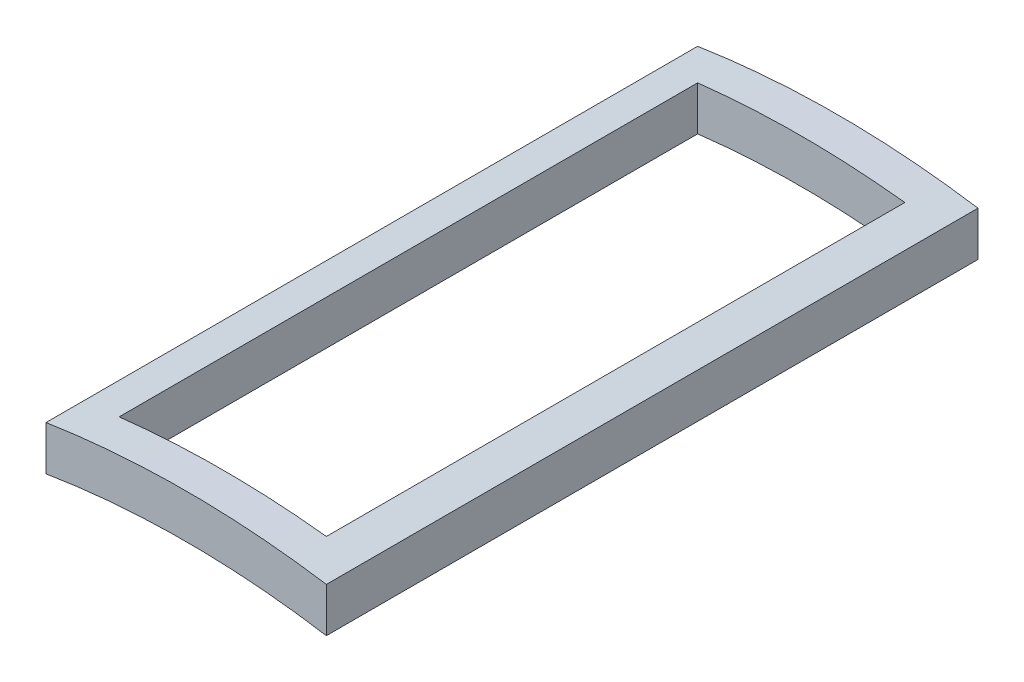
ISO-10303-21;
HEADER;
FILE_DESCRIPTION(('STEP AP214'),'2;1');
FILE_NAME('part.step','',(''),(''),'','','');
FILE_SCHEMA(('AUTOMOTIVE_DESIGN { 1 0 10303 214 1 1 1 1 }'));
ENDSEC;
DATA;
#1=APPLICATION_CONTEXT('core data for automotive mechanical design processes');
#2=APPLICATION_PROTOCOL_DEFINITION('international standard','automotive_design',2000,#1);
#3=PRODUCT_CONTEXT('',#1,'mechanical');
#4=PRODUCT('Part','Part','',(#3));
#5=PRODUCT_RELATED_PRODUCT_CATEGORY('part','',(#4));
#6=PRODUCT_DEFINITION_FORMATION('','',#4);
#7=PRODUCT_DEFINITION_CONTEXT('part definition',#1,'design');
#8=PRODUCT_DEFINITION('design','',#6,#7);
#9=PRODUCT_DEFINITION_SHAPE('','',#8);
#10=(LENGTH_UNIT() NAMED_UNIT(*) SI_UNIT(.MILLI.,.METRE.));
#11=(NAMED_UNIT(*) PLANE_ANGLE_UNIT() SI_UNIT($,.RADIAN.));
#12=(NAMED_UNIT(*) SI_UNIT($,.STERADIAN.) SOLID_ANGLE_UNIT());
#13=UNCERTAINTY_MEASURE_WITH_UNIT(LENGTH_MEASURE(1.E-05),#10,'distance_accuracy_value','');
#14=(GEOMETRIC_REPRESENTATION_CONTEXT(3) GLOBAL_UNCERTAINTY_ASSIGNED_CONTEXT((#13)) GLOBAL_UNIT_ASSIGNED_CONTEXT((#10,
#11,#12)) REPRESENTATION_CONTEXT('',''));
#15=CARTESIAN_POINT('',(0.,0.,0.));
#16=DIRECTION('',(0.,0.,1.));
#17=DIRECTION('',(1.,0.,0.));
#18=AXIS2_PLACEMENT_3D('',#15,#16,#17);
#19=CARTESIAN_POINT('',(-110.435261655171,-75.8999546142995,6.56206354763538));
#20=DIRECTION('',(0.,0.,1.));
#21=DIRECTION('',(0.,-1.,0.));
#22=AXIS2_PLACEMENT_3D('',#19,#20,#21);
#23=CYLINDRICAL_SURFACE('',#22,2.50000000000002);
#24=DIRECTION('',(0.,0.,1.));
#25=VECTOR('',#24,1.);
#26=CARTESIAN_POINT('',(-110.152003047214,-73.4160535371593,5.48543056897769));
#27=LINE('',#26,#25);
#28=CARTESIAN_POINT('',(-110.152003047214,-73.4160535371593,5.48543056897769));
#29=VERTEX_POINT('',#28);
#30=CARTESIAN_POINT('',(-110.152003047214,-73.4160535371593,3.90390334121821));
#31=VERTEX_POINT('',#30);
#32=EDGE_CURVE('E83',#29,#31,#27,.F.);
#33=ORIENTED_EDGE('',*,*,#32,.F.);
#34=CARTESIAN_POINT('',(-110.435261655171,-75.8999546142995,5.48543056897769));
#35=DIRECTION('',(0.,0.,1.));
#36=DIRECTION('',(0.,-1.,0.));
#37=AXIS2_PLACEMENT_3D('',#34,#35,#36);
#38=CIRCLE('',#37,2.50000000000002);
#39=CARTESIAN_POINT('',(-110.718520263128,-73.4160535371593,5.48543056897769));
#40=VERTEX_POINT('',#39);
#41=EDGE_CURVE('E93',#40,#29,#38,.F.);
#42=ORIENTED_EDGE('',*,*,#41,.F.);
#43=DIRECTION('',(0.,0.,-1.));
#44=VECTOR('',#43,1.);
#45=CARTESIAN_POINT('',(-110.718520263128,-73.4160535371594,3.90390334121821));
#46=LINE('',#45,#44);
#47=CARTESIAN_POINT('',(-110.718520263128,-73.4160535371593,3.90390334121821));
#48=VERTEX_POINT('',#47);
#49=EDGE_CURVE('E85',#48,#40,#46,.F.);
#50=ORIENTED_EDGE('',*,*,#49,.F.);
#51=CARTESIAN_POINT('',(-110.435261655171,-75.8999546142995,3.90390334121821));
#52=DIRECTION('',(0.,0.,1.));
#53=DIRECTION('',(0.,-1.,0.));
#54=AXIS2_PLACEMENT_3D('',#51,#52,#53);
#55=CIRCLE('',#54,2.50000000000002);
#56=EDGE_CURVE('E20',#48,#31,#55,.F.);
#57=ORIENTED_EDGE('',*,*,#56,.T.);
#58=EDGE_LOOP('',(#33,#42,#50,#57));
#59=FACE_BOUND('',#58,.T.);
#60=CARTESIAN_POINT('',(-110.435261655171,-75.8999546142995,5.58543056897769));
#61=DIRECTION('',(0.,0.,1.));
#62=DIRECTION('',(0.,-1.,0.));
#63=AXIS2_PLACEMENT_3D('',#60,#61,#62);
#64=CIRCLE('',#63,2.50000000000002);
#65=CARTESIAN_POINT('',(-110.052003047214,-73.4295067117063,5.58543056897769));
#66=VERTEX_POINT('',#65);
#67=CARTESIAN_POINT('',(-110.818520263128,-73.4295067117064,5.58543056897769));
#68=VERTEX_POINT('',#67);
#69=EDGE_CURVE('E86',#66,#68,#64,.T.);
#70=ORIENTED_EDGE('',*,*,#69,.F.);
#71=DIRECTION('',(0.,0.,-1.));
#72=VECTOR('',#71,1.);
#73=CARTESIAN_POINT('',(-110.052003047214,-73.4295067117063,3.80390334121821));
#74=LINE('',#73,#72);
#75=CARTESIAN_POINT('',(-110.052003047214,-73.4295067117063,3.80390334121821));
#76=VERTEX_POINT('',#75);
#77=EDGE_CURVE('E124',#76,#66,#74,.F.);
#78=ORIENTED_EDGE('',*,*,#77,.F.);
#79=CARTESIAN_POINT('',(-110.435261655171,-75.8999546142995,3.80390334121821));
#80=DIRECTION('',(0.,0.,1.));
#81=DIRECTION('',(0.,-1.,0.));
#82=AXIS2_PLACEMENT_3D('',#79,#80,#81);
#83=CIRCLE('',#82,2.50000000000002);
#84=CARTESIAN_POINT('',(-110.818520263128,-73.4295067117064,3.80390334121821));
#85=VERTEX_POINT('',#84);
#86=EDGE_CURVE('E113',#85,#76,#83,.F.);
#87=ORIENTED_EDGE('',*,*,#86,.F.);
#88=DIRECTION('',(0.,0.,1.));
#89=VECTOR('',#88,1.);
#90=CARTESIAN_POINT('',(-110.818520263128,-73.4295067117064,5.58543056897769));
#91=LINE('',#90,#89);
#92=EDGE_CURVE('E121',#68,#85,#91,.F.);
#93=ORIENTED_EDGE('',*,*,#92,.F.);
#94=EDGE_LOOP('',(#70,#78,#87,#93));
#95=FACE_BOUND('',#94,.T.);
#96=ADVANCED_FACE('F17',(#59,#95),#23,.T.);
#97=CARTESIAN_POINT('',(-110.052003047214,-76.3010935552146,5.58543056897769));
#98=DIRECTION('',(0.,0.,1.));
#99=DIRECTION('',(0.,-1.,0.));
#100=AXIS2_PLACEMENT_3D('',#97,#98,#99);
#101=PLANE('',#100);
#102=ORIENTED_EDGE('',*,*,#69,.T.);
#103=DIRECTION('',(0.,1.,0.));
#104=VECTOR('',#103,1.);
#105=CARTESIAN_POINT('',(-110.818520263128,-76.3010935552146,5.58543056897769));
#106=LINE('',#105,#104);
#107=CARTESIAN_POINT('',(-110.818520263128,-73.5510159519614,5.58543056897769));
#108=VERTEX_POINT('',#107);
#109=EDGE_CURVE('E112',#108,#68,#106,.T.);
#110=ORIENTED_EDGE('',*,*,#109,.F.);
#111=CARTESIAN_POINT('',(-110.435261655171,-75.8999546142995,5.58543056897769));
#112=DIRECTION('',(0.,0.,1.));
#113=DIRECTION('',(0.,-1.,0.));
#114=AXIS2_PLACEMENT_3D('',#111,#112,#113);
#115=CIRCLE('',#114,2.38000000000001);
#116=CARTESIAN_POINT('',(-110.052003047214,-73.5510159519614,5.58543056897769));
#117=VERTEX_POINT('',#116);
#118=EDGE_CURVE('E99',#108,#117,#115,.F.);
#119=ORIENTED_EDGE('',*,*,#118,.T.);
#120=DIRECTION('',(0.,1.,0.));
#121=VECTOR('',#120,1.);
#122=CARTESIAN_POINT('',(-110.052003047214,-76.3010935552146,5.58543056897769));
#123=LINE('',#122,#121);
#124=EDGE_CURVE('E122',#66,#117,#123,.F.);
#125=ORIENTED_EDGE('',*,*,#124,.F.);
#126=EDGE_LOOP('',(#102,#110,#119,#125));
#127=FACE_BOUND('',#126,.T.);
#128=ADVANCED_FACE('F141',(#127),#101,.T.);
#129=CARTESIAN_POINT('',(-110.052003047214,-76.3010935552146,3.80390334121821));
#130=DIRECTION('',(1.,0.,0.));
#131=DIRECTION('',(0.,0.,-1.));
#132=AXIS2_PLACEMENT_3D('',#129,#130,#131);
#133=PLANE('',#132);
#134=ORIENTED_EDGE('',*,*,#77,.T.);
#135=ORIENTED_EDGE('',*,*,#124,.T.);
#136=DIRECTION('',(0.,0.,1.));
#137=VECTOR('',#136,1.);
#138=CARTESIAN_POINT('',(-110.052003047214,-73.5510159519614,6.56206354763538));
#139=LINE('',#138,#137);
#140=CARTESIAN_POINT('',(-110.052003047214,-73.5510159519614,3.80390334121821));
#141=VERTEX_POINT('',#140);
#142=EDGE_CURVE('E114',#117,#141,#139,.F.);
#143=ORIENTED_EDGE('',*,*,#142,.T.);
#144=DIRECTION('',(0.,1.,0.));
#145=VECTOR('',#144,1.);
#146=CARTESIAN_POINT('',(-110.052003047214,-76.3010935552146,3.80390334121821));
#147=LINE('',#146,#145);
#148=EDGE_CURVE('E110',#76,#141,#147,.F.);
#149=ORIENTED_EDGE('',*,*,#148,.F.);
#150=EDGE_LOOP('',(#134,#135,#143,#149));
#151=FACE_BOUND('',#150,.T.);
#152=ADVANCED_FACE('F157',(#151),#133,.T.);
#153=CARTESIAN_POINT('',(-110.818520263128,-76.3010935552146,3.80390334121821));
#154=DIRECTION('',(0.,0.,-1.));
#155=DIRECTION('',(0.,1.,0.));
#156=AXIS2_PLACEMENT_3D('',#153,#154,#155);
#157=PLANE('',#156);
#158=ORIENTED_EDGE('',*,*,#86,.T.);
#159=ORIENTED_EDGE('',*,*,#148,.T.);
#160=CARTESIAN_POINT('',(-110.435261655171,-75.8999546142995,3.80390334121821));
#161=DIRECTION('',(0.,0.,1.));
#162=DIRECTION('',(0.,-1.,0.));
#163=AXIS2_PLACEMENT_3D('',#160,#161,#162);
#164=CIRCLE('',#163,2.38000000000001);
#165=CARTESIAN_POINT('',(-110.818520263128,-73.5510159519614,3.80390334121821));
#166=VERTEX_POINT('',#165);
#167=EDGE_CURVE('E117',#141,#166,#164,.T.);
#168=ORIENTED_EDGE('',*,*,#167,.T.);
#169=DIRECTION('',(0.,1.,0.));
#170=VECTOR('',#169,1.);
#171=CARTESIAN_POINT('',(-110.818520263128,-76.3010935552146,3.80390334121821));
#172=LINE('',#171,#170);
#173=EDGE_CURVE('E94',#85,#166,#172,.F.);
#174=ORIENTED_EDGE('',*,*,#173,.F.);
#175=EDGE_LOOP('',(#158,#159,#168,#174));
#176=FACE_BOUND('',#175,.T.);
#177=ADVANCED_FACE('F151',(#176),#157,.T.);
#178=CARTESIAN_POINT('',(-110.818520263128,-76.3010935552146,5.58543056897769));
#179=DIRECTION('',(-1.,0.,0.));
#180=DIRECTION('',(0.,0.,1.));
#181=AXIS2_PLACEMENT_3D('',#178,#179,#180);
#182=PLANE('',#181);
#183=ORIENTED_EDGE('',*,*,#92,.T.);
#184=ORIENTED_EDGE('',*,*,#173,.T.);
#185=DIRECTION('',(0.,0.,1.));
#186=VECTOR('',#185,1.);
#187=CARTESIAN_POINT('',(-110.818520263128,-73.5510159519614,6.56206354763538));
#188=LINE('',#187,#186);
#189=EDGE_CURVE('E107',#166,#108,#188,.T.);
#190=ORIENTED_EDGE('',*,*,#189,.T.);
#191=ORIENTED_EDGE('',*,*,#109,.T.);
#192=EDGE_LOOP('',(#183,#184,#190,#191));
#193=FACE_BOUND('',#192,.T.);
#194=ADVANCED_FACE('F145',(#193),#182,.T.);
#195=CARTESIAN_POINT('',(-110.152003047214,-76.3010935552146,5.48543056897769));
#196=DIRECTION('',(-1.,0.,0.));
#197=DIRECTION('',(0.,0.,1.));
#198=AXIS2_PLACEMENT_3D('',#195,#196,#197);
#199=PLANE('',#198);
#200=ORIENTED_EDGE('',*,*,#32,.T.);
#201=DIRECTION('',(0.,-1.,0.));
#202=VECTOR('',#201,1.);
#203=CARTESIAN_POINT('',(-110.152003047214,-76.3010935552146,3.90390334121821));
#204=LINE('',#203,#202);
#205=CARTESIAN_POINT('',(-110.152003047214,-73.5368709168782,3.90390334121821));
#206=VERTEX_POINT('',#205);
#207=EDGE_CURVE('E91',#206,#31,#204,.F.);
#208=ORIENTED_EDGE('',*,*,#207,.F.);
#209=DIRECTION('',(0.,0.,1.));
#210=VECTOR('',#209,1.);
#211=CARTESIAN_POINT('',(-110.152003047214,-73.5368709168782,6.56206354763538));
#212=LINE('',#211,#210);
#213=CARTESIAN_POINT('',(-110.152003047214,-73.5368709168782,5.48543056897769));
#214=VERTEX_POINT('',#213);
#215=EDGE_CURVE('E106',#206,#214,#212,.T.);
#216=ORIENTED_EDGE('',*,*,#215,.T.);
#217=DIRECTION('',(0.,1.,0.));
#218=VECTOR('',#217,1.);
#219=CARTESIAN_POINT('',(-110.152003047214,-76.3010935552146,5.48543056897769));
#220=LINE('',#219,#218);
#221=EDGE_CURVE('E92',#29,#214,#220,.F.);
#222=ORIENTED_EDGE('',*,*,#221,.F.);
#223=EDGE_LOOP('',(#200,#208,#216,#222));
#224=FACE_BOUND('',#223,.T.);
#225=ADVANCED_FACE('F89',(#224),#199,.T.);
#226=CARTESIAN_POINT('',(-110.718520263128,-76.3010935552146,5.48543056897769));
#227=DIRECTION('',(0.,0.,-1.));
#228=DIRECTION('',(0.,1.,0.));
#229=AXIS2_PLACEMENT_3D('',#226,#227,#228);
#230=PLANE('',#229);
#231=ORIENTED_EDGE('',*,*,#41,.T.);
#232=ORIENTED_EDGE('',*,*,#221,.T.);
#233=CARTESIAN_POINT('',(-110.435261655171,-75.8999546142995,5.48543056897769));
#234=DIRECTION('',(0.,0.,1.));
#235=DIRECTION('',(0.,-1.,0.));
#236=AXIS2_PLACEMENT_3D('',#233,#234,#235);
#237=CIRCLE('',#236,2.38000000000001);
#238=CARTESIAN_POINT('',(-110.718520263128,-73.5368709168782,5.48543056897769));
#239=VERTEX_POINT('',#238);
#240=EDGE_CURVE('E105',#214,#239,#237,.T.);
#241=ORIENTED_EDGE('',*,*,#240,.T.);
#242=DIRECTION('',(0.,1.,0.));
#243=VECTOR('',#242,1.);
#244=CARTESIAN_POINT('',(-110.718520263128,-76.3010935552146,5.48543056897769));
#245=LINE('',#244,#243);
#246=EDGE_CURVE('E97',#40,#239,#245,.F.);
#247=ORIENTED_EDGE('',*,*,#246,.F.);
#248=EDGE_LOOP('',(#231,#232,#241,#247));
#249=FACE_BOUND('',#248,.T.);
#250=ADVANCED_FACE('F178',(#249),#230,.T.);
#251=CARTESIAN_POINT('',(-110.718520263128,-76.3010935552146,3.90390334121821));
#252=DIRECTION('',(1.,0.,0.));
#253=DIRECTION('',(0.,0.,-1.));
#254=AXIS2_PLACEMENT_3D('',#251,#252,#253);
#255=PLANE('',#254);
#256=ORIENTED_EDGE('',*,*,#49,.T.);
#257=ORIENTED_EDGE('',*,*,#246,.T.);
#258=DIRECTION('',(0.,0.,1.));
#259=VECTOR('',#258,1.);
#260=CARTESIAN_POINT('',(-110.718520263128,-73.5368709168782,6.56206354763538));
#261=LINE('',#260,#259);
#262=CARTESIAN_POINT('',(-110.718520263128,-73.5368709168782,3.90390334121821));
#263=VERTEX_POINT('',#262);
#264=EDGE_CURVE('E26',#239,#263,#261,.F.);
#265=ORIENTED_EDGE('',*,*,#264,.T.);
#266=DIRECTION('',(0.,-1.,0.));
#267=VECTOR('',#266,1.);
#268=CARTESIAN_POINT('',(-110.718520263128,-76.3010935552146,3.90390334121821));
#269=LINE('',#268,#267);
#270=EDGE_CURVE('E34',#48,#263,#269,.T.);
#271=ORIENTED_EDGE('',*,*,#270,.F.);
#272=EDGE_LOOP('',(#256,#257,#265,#271));
#273=FACE_BOUND('',#272,.T.);
#274=ADVANCED_FACE('F172',(#273),#255,.T.);
#275=CARTESIAN_POINT('',(-110.152003047214,-76.3010935552146,3.90390334121821));
#276=DIRECTION('',(0.,0.,1.));
#277=DIRECTION('',(0.,-1.,0.));
#278=AXIS2_PLACEMENT_3D('',#275,#276,#277);
#279=PLANE('',#278);
#280=ORIENTED_EDGE('',*,*,#56,.F.);
#281=ORIENTED_EDGE('',*,*,#270,.T.);
#282=CARTESIAN_POINT('',(-110.435261655171,-75.8999546142995,3.90390334121821));
#283=DIRECTION('',(0.,0.,1.));
#284=DIRECTION('',(0.,-1.,0.));
#285=AXIS2_PLACEMENT_3D('',#282,#283,#284);
#286=CIRCLE('',#285,2.38000000000001);
#287=EDGE_CURVE('E11',#263,#206,#286,.F.);
#288=ORIENTED_EDGE('',*,*,#287,.T.);
#289=ORIENTED_EDGE('',*,*,#207,.T.);
#290=EDGE_LOOP('',(#280,#281,#288,#289));
#291=FACE_BOUND('',#290,.T.);
#292=ADVANCED_FACE('F96',(#291),#279,.T.);
#293=CARTESIAN_POINT('',(-110.435261655171,-75.8999546142995,6.56206354763538));
#294=DIRECTION('',(0.,0.,1.));
#295=DIRECTION('',(0.,-1.,0.));
#296=AXIS2_PLACEMENT_3D('',#293,#294,#295);
#297=CYLINDRICAL_SURFACE('',#296,2.38000000000001);
#298=ORIENTED_EDGE('',*,*,#264,.F.);
#299=ORIENTED_EDGE('',*,*,#240,.F.);
#300=ORIENTED_EDGE('',*,*,#215,.F.);
#301=ORIENTED_EDGE('',*,*,#287,.F.);
#302=EDGE_LOOP('',(#298,#299,#300,#301));
#303=FACE_BOUND('',#302,.T.);
#304=ORIENTED_EDGE('',*,*,#167,.F.);
#305=ORIENTED_EDGE('',*,*,#142,.F.);
#306=ORIENTED_EDGE('',*,*,#118,.F.);
#307=ORIENTED_EDGE('',*,*,#189,.F.);
#308=EDGE_LOOP('',(#304,#305,#306,#307));
#309=FACE_BOUND('',#308,.T.);
#310=ADVANCED_FACE('F154',(#303,#309),#297,.F.);
#311=CLOSED_SHELL('',(#96,#128,#152,#177,#194,#225,#250,#274,#292,#310));
#312=MANIFOLD_SOLID_BREP('B1',#311);
#313=ADVANCED_BREP_SHAPE_REPRESENTATION('',(#18,#312),#14);
#314=SHAPE_DEFINITION_REPRESENTATION(#9,#313);
ENDSEC;
END-ISO-10303-21;
